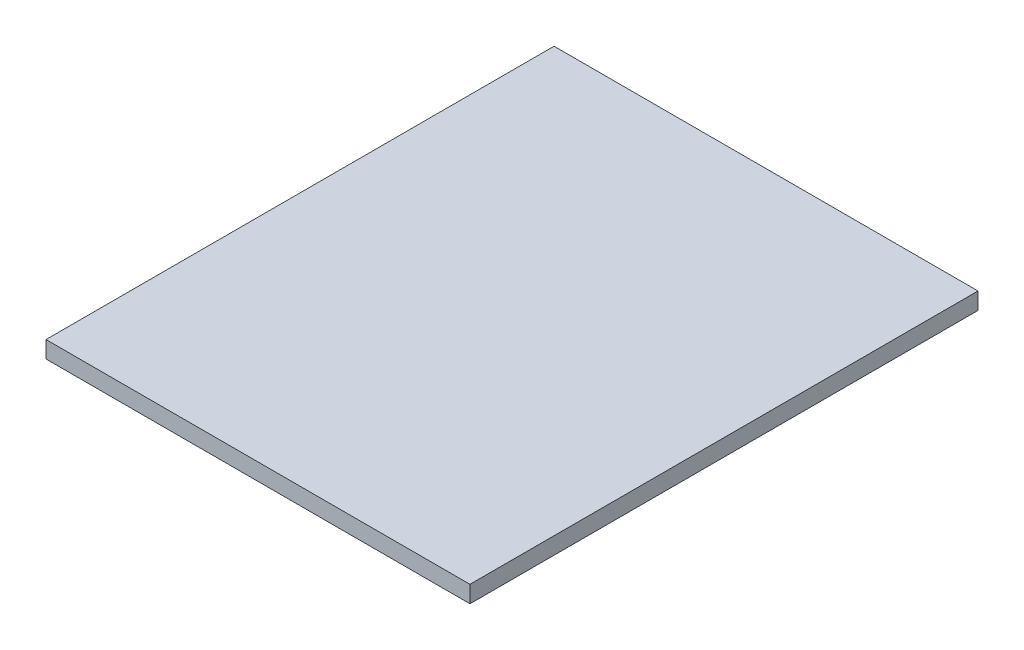
ISO-10303-21;
HEADER;
FILE_DESCRIPTION(('STEP AP214'),'2;1');
FILE_NAME('part.step','',(''),(''),'','','');
FILE_SCHEMA(('AUTOMOTIVE_DESIGN { 1 0 10303 214 1 1 1 1 }'));
ENDSEC;
DATA;
#1=APPLICATION_CONTEXT('core data for automotive mechanical design processes');
#2=APPLICATION_PROTOCOL_DEFINITION('international standard','automotive_design',2000,#1);
#3=PRODUCT_CONTEXT('',#1,'mechanical');
#4=PRODUCT('Part','Part','',(#3));
#5=PRODUCT_RELATED_PRODUCT_CATEGORY('part','',(#4));
#6=PRODUCT_DEFINITION_FORMATION('','',#4);
#7=PRODUCT_DEFINITION_CONTEXT('part definition',#1,'design');
#8=PRODUCT_DEFINITION('design','',#6,#7);
#9=PRODUCT_DEFINITION_SHAPE('','',#8);
#10=(LENGTH_UNIT() NAMED_UNIT(*) SI_UNIT(.MILLI.,.METRE.));
#11=(NAMED_UNIT(*) PLANE_ANGLE_UNIT() SI_UNIT($,.RADIAN.));
#12=(NAMED_UNIT(*) SI_UNIT($,.STERADIAN.) SOLID_ANGLE_UNIT());
#13=UNCERTAINTY_MEASURE_WITH_UNIT(LENGTH_MEASURE(1.E-05),#10,'distance_accuracy_value','');
#14=(GEOMETRIC_REPRESENTATION_CONTEXT(3) GLOBAL_UNCERTAINTY_ASSIGNED_CONTEXT((#13)) GLOBAL_UNIT_ASSIGNED_CONTEXT((#10,
#11,#12)) REPRESENTATION_CONTEXT('',''));
#15=CARTESIAN_POINT('',(0.,0.,0.));
#16=DIRECTION('',(0.,0.,1.));
#17=DIRECTION('',(1.,0.,0.));
#18=AXIS2_PLACEMENT_3D('',#15,#16,#17);
#19=CARTESIAN_POINT('',(132.504686195267,19.05,-327.215848627682));
#20=DIRECTION('',(-1.,0.,0.));
#21=DIRECTION('',(0.,0.,1.));
#22=AXIS2_PLACEMENT_3D('',#19,#20,#21);
#23=PLANE('',#22);
#24=DIRECTION('',(0.,0.,-1.));
#25=VECTOR('',#24,1.);
#26=CARTESIAN_POINT('',(132.504686195267,0.,-327.215848627682));
#27=LINE('',#26,#25);
#28=CARTESIAN_POINT('',(132.504686195267,0.,246.222155164156));
#29=VERTEX_POINT('',#28);
#30=CARTESIAN_POINT('',(132.504686195267,0.,-327.215848627682));
#31=VERTEX_POINT('',#30);
#32=EDGE_CURVE('E96',#29,#31,#27,.T.);
#33=ORIENTED_EDGE('',*,*,#32,.T.);
#34=DIRECTION('',(0.,-1.,0.));
#35=VECTOR('',#34,1.);
#36=CARTESIAN_POINT('',(132.504686195267,19.05,-327.215848627682));
#37=LINE('',#36,#35);
#38=CARTESIAN_POINT('',(132.504686195267,19.05,-327.215848627682));
#39=VERTEX_POINT('',#38);
#40=EDGE_CURVE('E11',#39,#31,#37,.T.);
#41=ORIENTED_EDGE('',*,*,#40,.F.);
#42=DIRECTION('',(0.,0.,-1.));
#43=VECTOR('',#42,1.);
#44=CARTESIAN_POINT('',(132.504686195267,19.05,-327.215848627682));
#45=LINE('',#44,#43);
#46=CARTESIAN_POINT('',(132.504686195267,19.05,246.222155164156));
#47=VERTEX_POINT('',#46);
#48=EDGE_CURVE('E84',#47,#39,#45,.T.);
#49=ORIENTED_EDGE('',*,*,#48,.F.);
#50=DIRECTION('',(0.,-1.,0.));
#51=VECTOR('',#50,1.);
#52=CARTESIAN_POINT('',(132.504686195267,19.05,246.222155164156));
#53=LINE('',#52,#51);
#54=EDGE_CURVE('E92',#47,#29,#53,.T.);
#55=ORIENTED_EDGE('',*,*,#54,.T.);
#56=EDGE_LOOP('',(#33,#41,#49,#55));
#57=FACE_BOUND('',#56,.T.);
#58=ADVANCED_FACE('F33',(#57),#23,.F.);
#59=CARTESIAN_POINT('',(-345.99531380473,19.05,-327.215848627682));
#60=DIRECTION('',(0.,0.,1.));
#61=DIRECTION('',(1.,0.,0.));
#62=AXIS2_PLACEMENT_3D('',#59,#60,#61);
#63=PLANE('',#62);
#64=DIRECTION('',(-1.,0.,0.));
#65=VECTOR('',#64,1.);
#66=CARTESIAN_POINT('',(-345.99531380473,0.,-327.215848627682));
#67=LINE('',#66,#65);
#68=CARTESIAN_POINT('',(-345.99531380473,0.,-327.215848627682));
#69=VERTEX_POINT('',#68);
#70=EDGE_CURVE('E88',#31,#69,#67,.T.);
#71=ORIENTED_EDGE('',*,*,#70,.T.);
#72=DIRECTION('',(0.,-1.,0.));
#73=VECTOR('',#72,1.);
#74=CARTESIAN_POINT('',(-345.99531380473,19.05,-327.215848627682));
#75=LINE('',#74,#73);
#76=CARTESIAN_POINT('',(-345.99531380473,19.05,-327.215848627682));
#77=VERTEX_POINT('',#76);
#78=EDGE_CURVE('E41',#77,#69,#75,.T.);
#79=ORIENTED_EDGE('',*,*,#78,.F.);
#80=DIRECTION('',(-1.,0.,0.));
#81=VECTOR('',#80,1.);
#82=CARTESIAN_POINT('',(-345.99531380473,19.05,-327.215848627682));
#83=LINE('',#82,#81);
#84=EDGE_CURVE('E79',#39,#77,#83,.T.);
#85=ORIENTED_EDGE('',*,*,#84,.F.);
#86=ORIENTED_EDGE('',*,*,#40,.T.);
#87=EDGE_LOOP('',(#71,#79,#85,#86));
#88=FACE_BOUND('',#87,.T.);
#89=ADVANCED_FACE('F87',(#88),#63,.F.);
#90=CARTESIAN_POINT('',(-345.99531380473,19.05,-327.215848627682));
#91=DIRECTION('',(1.,0.,0.));
#92=DIRECTION('',(0.,0.,-1.));
#93=AXIS2_PLACEMENT_3D('',#90,#91,#92);
#94=PLANE('',#93);
#95=DIRECTION('',(0.,0.,1.));
#96=VECTOR('',#95,1.);
#97=CARTESIAN_POINT('',(-345.99531380473,0.,-327.215848627682));
#98=LINE('',#97,#96);
#99=CARTESIAN_POINT('',(-345.99531380473,0.,246.222155164156));
#100=VERTEX_POINT('',#99);
#101=EDGE_CURVE('E66',#69,#100,#98,.T.);
#102=ORIENTED_EDGE('',*,*,#101,.T.);
#103=DIRECTION('',(0.,-1.,0.));
#104=VECTOR('',#103,1.);
#105=CARTESIAN_POINT('',(-345.99531380473,19.05,246.222155164156));
#106=LINE('',#105,#104);
#107=CARTESIAN_POINT('',(-345.99531380473,19.05,246.222155164156));
#108=VERTEX_POINT('',#107);
#109=EDGE_CURVE('E89',#108,#100,#106,.T.);
#110=ORIENTED_EDGE('',*,*,#109,.F.);
#111=DIRECTION('',(0.,0.,1.));
#112=VECTOR('',#111,1.);
#113=CARTESIAN_POINT('',(-345.99531380473,19.05,-327.215848627682));
#114=LINE('',#113,#112);
#115=EDGE_CURVE('E82',#77,#108,#114,.T.);
#116=ORIENTED_EDGE('',*,*,#115,.F.);
#117=ORIENTED_EDGE('',*,*,#78,.T.);
#118=EDGE_LOOP('',(#102,#110,#116,#117));
#119=FACE_BOUND('',#118,.T.);
#120=ADVANCED_FACE('F90',(#119),#94,.F.);
#121=CARTESIAN_POINT('',(-345.99531380473,19.05,246.222155164156));
#122=DIRECTION('',(0.,0.,-1.));
#123=DIRECTION('',(-1.,0.,0.));
#124=AXIS2_PLACEMENT_3D('',#121,#122,#123);
#125=PLANE('',#124);
#126=DIRECTION('',(1.,0.,0.));
#127=VECTOR('',#126,1.);
#128=CARTESIAN_POINT('',(-345.99531380473,0.,246.222155164156));
#129=LINE('',#128,#127);
#130=EDGE_CURVE('E72',#100,#29,#129,.T.);
#131=ORIENTED_EDGE('',*,*,#130,.T.);
#132=ORIENTED_EDGE('',*,*,#54,.F.);
#133=DIRECTION('',(1.,0.,0.));
#134=VECTOR('',#133,1.);
#135=CARTESIAN_POINT('',(-345.99531380473,19.05,246.222155164156));
#136=LINE('',#135,#134);
#137=EDGE_CURVE('E49',#108,#47,#136,.T.);
#138=ORIENTED_EDGE('',*,*,#137,.F.);
#139=ORIENTED_EDGE('',*,*,#109,.T.);
#140=EDGE_LOOP('',(#131,#132,#138,#139));
#141=FACE_BOUND('',#140,.T.);
#142=ADVANCED_FACE('F103',(#141),#125,.F.);
#143=CARTESIAN_POINT('',(0.,19.05,0.));
#144=DIRECTION('',(0.,1.,0.));
#145=DIRECTION('',(0.,0.,1.));
#146=AXIS2_PLACEMENT_3D('',#143,#144,#145);
#147=PLANE('',#146);
#148=ORIENTED_EDGE('',*,*,#48,.T.);
#149=ORIENTED_EDGE('',*,*,#84,.T.);
#150=ORIENTED_EDGE('',*,*,#115,.T.);
#151=ORIENTED_EDGE('',*,*,#137,.T.);
#152=EDGE_LOOP('',(#148,#149,#150,#151));
#153=FACE_BOUND('',#152,.T.);
#154=ADVANCED_FACE('F80',(#153),#147,.T.);
#155=CARTESIAN_POINT('',(0.,0.,0.));
#156=DIRECTION('',(0.,1.,0.));
#157=DIRECTION('',(0.,0.,1.));
#158=AXIS2_PLACEMENT_3D('',#155,#156,#157);
#159=PLANE('',#158);
#160=ORIENTED_EDGE('',*,*,#32,.F.);
#161=ORIENTED_EDGE('',*,*,#130,.F.);
#162=ORIENTED_EDGE('',*,*,#101,.F.);
#163=ORIENTED_EDGE('',*,*,#70,.F.);
#164=EDGE_LOOP('',(#160,#161,#162,#163));
#165=FACE_BOUND('',#164,.T.);
#166=ADVANCED_FACE('F106',(#165),#159,.F.);
#167=CLOSED_SHELL('',(#58,#89,#120,#142,#154,#166));
#168=MANIFOLD_SOLID_BREP('B2',#167);
#169=ADVANCED_BREP_SHAPE_REPRESENTATION('',(#18,#168),#14);
#170=SHAPE_DEFINITION_REPRESENTATION(#9,#169);
ENDSEC;
END-ISO-10303-21;
